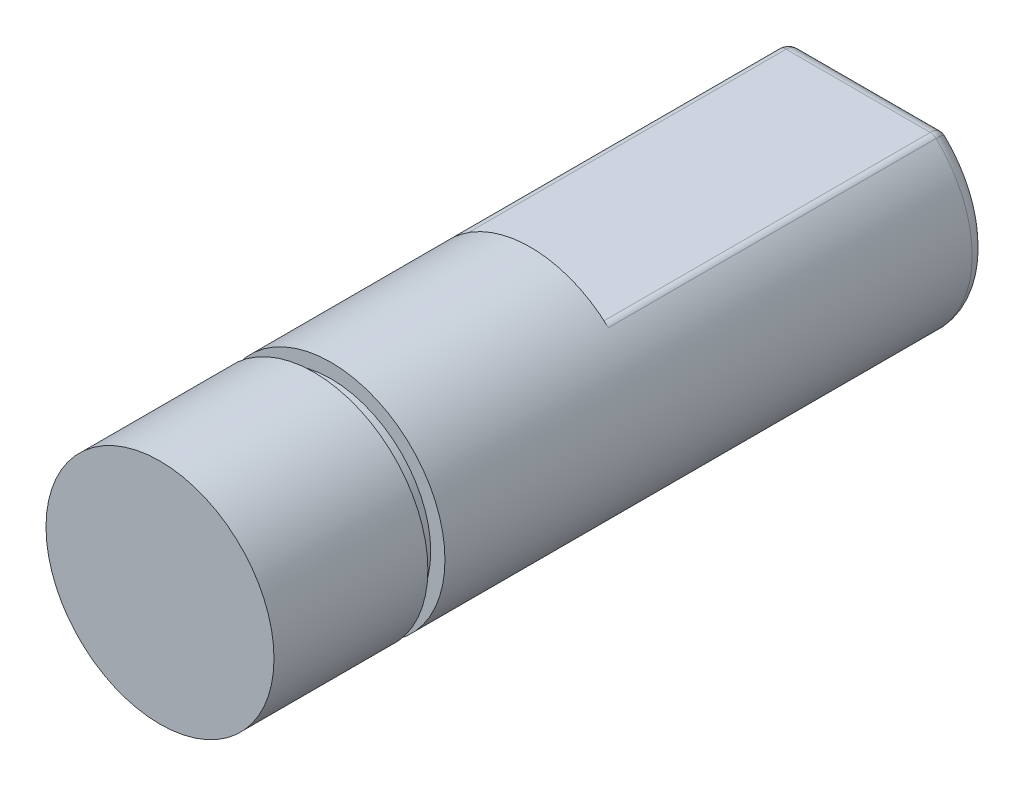
ISO-10303-21;
HEADER;
FILE_DESCRIPTION(('STEP AP214'),'2;1');
FILE_NAME('part.step','',(''),(''),'','','');
FILE_SCHEMA(('AUTOMOTIVE_DESIGN { 1 0 10303 214 1 1 1 1 }'));
ENDSEC;
DATA;
#1=APPLICATION_CONTEXT('core data for automotive mechanical design processes');
#2=APPLICATION_PROTOCOL_DEFINITION('international standard','automotive_design',2000,#1);
#3=PRODUCT_CONTEXT('',#1,'mechanical');
#4=PRODUCT('Part','Part','',(#3));
#5=PRODUCT_RELATED_PRODUCT_CATEGORY('part','',(#4));
#6=PRODUCT_DEFINITION_FORMATION('','',#4);
#7=PRODUCT_DEFINITION_CONTEXT('part definition',#1,'design');
#8=PRODUCT_DEFINITION('design','',#6,#7);
#9=PRODUCT_DEFINITION_SHAPE('','',#8);
#10=(LENGTH_UNIT() NAMED_UNIT(*) SI_UNIT(.MILLI.,.METRE.));
#11=(NAMED_UNIT(*) PLANE_ANGLE_UNIT() SI_UNIT($,.RADIAN.));
#12=(NAMED_UNIT(*) SI_UNIT($,.STERADIAN.) SOLID_ANGLE_UNIT());
#13=UNCERTAINTY_MEASURE_WITH_UNIT(LENGTH_MEASURE(1.E-05),#10,'distance_accuracy_value','');
#14=(GEOMETRIC_REPRESENTATION_CONTEXT(3) GLOBAL_UNCERTAINTY_ASSIGNED_CONTEXT((#13)) GLOBAL_UNIT_ASSIGNED_CONTEXT((#10,
#11,#12)) REPRESENTATION_CONTEXT('',''));
#15=CARTESIAN_POINT('',(0.,0.,0.));
#16=DIRECTION('',(0.,0.,1.));
#17=DIRECTION('',(1.,0.,0.));
#18=AXIS2_PLACEMENT_3D('',#15,#16,#17);
#19=CARTESIAN_POINT('',(0.,0.,25.));
#20=DIRECTION('',(0.,0.,-1.));
#21=DIRECTION('',(-1.,0.,0.));
#22=AXIS2_PLACEMENT_3D('',#19,#20,#21);
#23=CYLINDRICAL_SURFACE('',#22,4.);
#24=CARTESIAN_POINT('',(0.,0.,19.6));
#25=DIRECTION('',(0.,0.,-1.));
#26=DIRECTION('',(-1.,0.,0.));
#27=AXIS2_PLACEMENT_3D('',#24,#25,#26);
#28=CIRCLE('',#27,4.);
#29=CARTESIAN_POINT('',(-4.,0.,19.6));
#30=VERTEX_POINT('',#29);
#31=EDGE_CURVE('E189',#30,#30,#28,.T.);
#32=ORIENTED_EDGE('',*,*,#31,.F.);
#33=EDGE_LOOP('',(#32));
#34=FACE_BOUND('',#33,.T.);
#35=CARTESIAN_POINT('',(0.,0.,25.));
#36=DIRECTION('',(0.,0.,1.));
#37=DIRECTION('',(1.,0.,0.));
#38=AXIS2_PLACEMENT_3D('',#35,#36,#37);
#39=CIRCLE('',#38,4.);
#40=CARTESIAN_POINT('',(4.,0.,25.));
#41=VERTEX_POINT('',#40);
#42=EDGE_CURVE('E207',#41,#41,#39,.T.);
#43=ORIENTED_EDGE('',*,*,#42,.F.);
#44=EDGE_LOOP('',(#43));
#45=FACE_BOUND('',#44,.T.);
#46=ADVANCED_FACE('F34',(#34,#45),#23,.T.);
#47=CARTESIAN_POINT('',(0.,0.,25.));
#48=DIRECTION('',(0.,0.,1.));
#49=DIRECTION('',(1.,0.,0.));
#50=AXIS2_PLACEMENT_3D('',#47,#48,#49);
#51=PLANE('',#50);
#52=ORIENTED_EDGE('',*,*,#42,.T.);
#53=EDGE_LOOP('',(#52));
#54=FACE_BOUND('',#53,.T.);
#55=ADVANCED_FACE('F231',(#54),#51,.T.);
#56=CARTESIAN_POINT('',(0.,4.,19.6));
#57=DIRECTION('',(0.,0.,1.));
#58=DIRECTION('',(1.,0.,0.));
#59=AXIS2_PLACEMENT_3D('',#56,#57,#58);
#60=PLANE('',#59);
#61=CARTESIAN_POINT('',(0.,0.,19.6));
#62=DIRECTION('',(0.,0.,-1.));
#63=DIRECTION('',(-1.,0.,0.));
#64=AXIS2_PLACEMENT_3D('',#61,#62,#63);
#65=CIRCLE('',#64,3.5);
#66=CARTESIAN_POINT('',(-3.5,0.,19.6));
#67=VERTEX_POINT('',#66);
#68=EDGE_CURVE('E202',#67,#67,#65,.T.);
#69=ORIENTED_EDGE('',*,*,#68,.F.);
#70=EDGE_LOOP('',(#69));
#71=FACE_BOUND('',#70,.T.);
#72=ORIENTED_EDGE('',*,*,#31,.T.);
#73=EDGE_LOOP('',(#72));
#74=FACE_BOUND('',#73,.T.);
#75=ADVANCED_FACE('F236',(#71,#74),#60,.F.);
#76=CARTESIAN_POINT('',(0.,0.,0.));
#77=DIRECTION('',(0.,0.,-1.));
#78=DIRECTION('',(-1.,0.,0.));
#79=AXIS2_PLACEMENT_3D('',#76,#77,#78);
#80=CYLINDRICAL_SURFACE('',#79,3.5);
#81=CARTESIAN_POINT('',(0.,0.,19.));
#82=DIRECTION('',(0.,0.,-1.));
#83=DIRECTION('',(-1.,0.,0.));
#84=AXIS2_PLACEMENT_3D('',#81,#82,#83);
#85=CIRCLE('',#84,3.5);
#86=CARTESIAN_POINT('',(-3.5,0.,19.));
#87=VERTEX_POINT('',#86);
#88=EDGE_CURVE('E199',#87,#87,#85,.T.);
#89=ORIENTED_EDGE('',*,*,#88,.F.);
#90=EDGE_LOOP('',(#89));
#91=FACE_BOUND('',#90,.T.);
#92=ORIENTED_EDGE('',*,*,#68,.T.);
#93=EDGE_LOOP('',(#92));
#94=FACE_BOUND('',#93,.T.);
#95=ADVANCED_FACE('F253',(#91,#94),#80,.T.);
#96=CARTESIAN_POINT('',(0.,4.,19.));
#97=DIRECTION('',(0.,0.,-1.));
#98=DIRECTION('',(-1.,0.,0.));
#99=AXIS2_PLACEMENT_3D('',#96,#97,#98);
#100=PLANE('',#99);
#101=CARTESIAN_POINT('',(0.,0.,19.));
#102=DIRECTION('',(0.,0.,-1.));
#103=DIRECTION('',(-1.,0.,0.));
#104=AXIS2_PLACEMENT_3D('',#101,#102,#103);
#105=CIRCLE('',#104,4.);
#106=CARTESIAN_POINT('',(-4.,0.,19.));
#107=VERTEX_POINT('',#106);
#108=EDGE_CURVE('E194',#107,#107,#105,.T.);
#109=ORIENTED_EDGE('',*,*,#108,.F.);
#110=EDGE_LOOP('',(#109));
#111=FACE_BOUND('',#110,.T.);
#112=ORIENTED_EDGE('',*,*,#88,.T.);
#113=EDGE_LOOP('',(#112));
#114=FACE_BOUND('',#113,.T.);
#115=ADVANCED_FACE('F248',(#111,#114),#100,.F.);
#116=CARTESIAN_POINT('',(-4.,4.,12.));
#117=DIRECTION('',(0.,0.,1.));
#118=DIRECTION('',(1.,0.,0.));
#119=AXIS2_PLACEMENT_3D('',#116,#117,#118);
#120=PLANE('',#119);
#121=DIRECTION('',(1.,0.,0.));
#122=VECTOR('',#121,1.);
#123=CARTESIAN_POINT('',(-4.,3.,12.));
#124=LINE('',#123,#122);
#125=CARTESIAN_POINT('',(-2.52982212813471,3.,12.));
#126=VERTEX_POINT('',#125);
#127=CARTESIAN_POINT('',(2.52982212813471,3.,12.));
#128=VERTEX_POINT('',#127);
#129=EDGE_CURVE('E205',#126,#128,#124,.T.);
#130=ORIENTED_EDGE('',*,*,#129,.F.);
#131=CARTESIAN_POINT('',(-2.52982212813471,2.7,12.));
#132=DIRECTION('',(0.,0.,1.));
#133=DIRECTION('',(1.,0.,0.));
#134=AXIS2_PLACEMENT_3D('',#131,#132,#133);
#135=CIRCLE('',#134,0.3);
#136=CARTESIAN_POINT('',(-2.73494284122671,2.91891891891892,12.));
#137=VERTEX_POINT('',#136);
#138=EDGE_CURVE('E48',#126,#137,#135,.T.);
#139=ORIENTED_EDGE('',*,*,#138,.T.);
#140=CARTESIAN_POINT('',(0.,0.,12.));
#141=DIRECTION('',(0.,0.,1.));
#142=DIRECTION('',(1.,0.,0.));
#143=AXIS2_PLACEMENT_3D('',#140,#141,#142);
#144=CIRCLE('',#143,4.);
#145=CARTESIAN_POINT('',(2.73494284122671,2.91891891891892,12.));
#146=VERTEX_POINT('',#145);
#147=EDGE_CURVE('E210',#146,#137,#144,.T.);
#148=ORIENTED_EDGE('',*,*,#147,.F.);
#149=CARTESIAN_POINT('',(2.52982212813471,2.7,12.));
#150=DIRECTION('',(0.,0.,1.));
#151=DIRECTION('',(1.,0.,0.));
#152=AXIS2_PLACEMENT_3D('',#149,#150,#151);
#153=CIRCLE('',#152,0.3);
#154=EDGE_CURVE('E11',#146,#128,#153,.T.);
#155=ORIENTED_EDGE('',*,*,#154,.T.);
#156=EDGE_LOOP('',(#130,#139,#148,#155));
#157=FACE_BOUND('',#156,.T.);
#158=ADVANCED_FACE('F245',(#157),#120,.F.);
#159=CARTESIAN_POINT('',(-4.,3.,0.));
#160=DIRECTION('',(0.,-1.,0.));
#161=DIRECTION('',(0.,0.,-1.));
#162=AXIS2_PLACEMENT_3D('',#159,#160,#161);
#163=PLANE('',#162);
#164=DIRECTION('',(1.,0.,0.));
#165=VECTOR('',#164,1.);
#166=CARTESIAN_POINT('',(-4.,3.,0.5));
#167=LINE('',#166,#165);
#168=CARTESIAN_POINT('',(2.52982212813471,3.,0.5));
#169=VERTEX_POINT('',#168);
#170=CARTESIAN_POINT('',(-2.52982212813471,3.,0.5));
#171=VERTEX_POINT('',#170);
#172=EDGE_CURVE('E108',#169,#171,#167,.F.);
#173=ORIENTED_EDGE('',*,*,#172,.T.);
#174=DIRECTION('',(0.,0.,-1.));
#175=VECTOR('',#174,1.);
#176=CARTESIAN_POINT('',(-2.52982212813471,3.,0.));
#177=LINE('',#176,#175);
#178=EDGE_CURVE('E61',#171,#126,#177,.F.);
#179=ORIENTED_EDGE('',*,*,#178,.T.);
#180=ORIENTED_EDGE('',*,*,#129,.T.);
#181=DIRECTION('',(0.,0.,-1.));
#182=VECTOR('',#181,1.);
#183=CARTESIAN_POINT('',(2.52982212813471,3.,0.));
#184=LINE('',#183,#182);
#185=EDGE_CURVE('E277',#128,#169,#184,.T.);
#186=ORIENTED_EDGE('',*,*,#185,.T.);
#187=EDGE_LOOP('',(#173,#179,#180,#186));
#188=FACE_BOUND('',#187,.T.);
#189=ADVANCED_FACE('F243',(#188),#163,.F.);
#190=CARTESIAN_POINT('',(0.,0.,0.));
#191=DIRECTION('',(0.,0.,1.));
#192=DIRECTION('',(1.,0.,0.));
#193=AXIS2_PLACEMENT_3D('',#190,#191,#192);
#194=PLANE('',#193);
#195=CARTESIAN_POINT('',(0.,0.,0.));
#196=DIRECTION('',(0.,0.,1.));
#197=DIRECTION('',(1.,0.,0.));
#198=AXIS2_PLACEMENT_3D('',#195,#196,#197);
#199=CIRCLE('',#198,3.5);
#200=CARTESIAN_POINT('',(2.44948974278318,2.5,0.));
#201=VERTEX_POINT('',#200);
#202=CARTESIAN_POINT('',(-2.44948974278318,2.5,0.));
#203=VERTEX_POINT('',#202);
#204=EDGE_CURVE('E112',#201,#203,#199,.F.);
#205=ORIENTED_EDGE('',*,*,#204,.T.);
#206=DIRECTION('',(1.,0.,0.));
#207=VECTOR('',#206,1.);
#208=CARTESIAN_POINT('',(0.,2.5,0.));
#209=LINE('',#208,#207);
#210=EDGE_CURVE('E106',#203,#201,#209,.T.);
#211=ORIENTED_EDGE('',*,*,#210,.T.);
#212=EDGE_LOOP('',(#205,#211));
#213=FACE_BOUND('',#212,.T.);
#214=CARTESIAN_POINT('',(0.,0.,0.));
#215=DIRECTION('',(0.,0.,1.));
#216=DIRECTION('',(1.,0.,0.));
#217=AXIS2_PLACEMENT_3D('',#214,#215,#216);
#218=CIRCLE('',#217,2.);
#219=CARTESIAN_POINT('',(2.,0.,0.));
#220=VERTEX_POINT('',#219);
#221=EDGE_CURVE('E116',#220,#220,#218,.T.);
#222=ORIENTED_EDGE('',*,*,#221,.T.);
#223=EDGE_LOOP('',(#222));
#224=FACE_BOUND('',#223,.T.);
#225=ADVANCED_FACE('F118',(#213,#224),#194,.F.);
#226=ORIENTED_EDGE('',*,*,#108,.T.);
#227=EDGE_LOOP('',(#226));
#228=FACE_BOUND('',#227,.T.);
#229=ORIENTED_EDGE('',*,*,#147,.T.);
#230=DIRECTION('',(0.,0.,-1.));
#231=VECTOR('',#230,1.);
#232=CARTESIAN_POINT('',(-2.73494284122671,2.91891891891892,25.));
#233=LINE('',#232,#231);
#234=CARTESIAN_POINT('',(-2.73494284122671,2.91891891891892,0.5));
#235=VERTEX_POINT('',#234);
#236=EDGE_CURVE('E271',#137,#235,#233,.T.);
#237=ORIENTED_EDGE('',*,*,#236,.T.);
#238=CARTESIAN_POINT('',(0.,0.,0.5));
#239=DIRECTION('',(0.,0.,1.));
#240=DIRECTION('',(1.,0.,0.));
#241=AXIS2_PLACEMENT_3D('',#238,#239,#240);
#242=CIRCLE('',#241,4.);
#243=CARTESIAN_POINT('',(2.73494284122671,2.91891891891892,0.5));
#244=VERTEX_POINT('',#243);
#245=EDGE_CURVE('E121',#235,#244,#242,.T.);
#246=ORIENTED_EDGE('',*,*,#245,.T.);
#247=DIRECTION('',(0.,0.,-1.));
#248=VECTOR('',#247,1.);
#249=CARTESIAN_POINT('',(2.73494284122671,2.91891891891892,25.));
#250=LINE('',#249,#248);
#251=EDGE_CURVE('E273',#244,#146,#250,.F.);
#252=ORIENTED_EDGE('',*,*,#251,.T.);
#253=EDGE_LOOP('',(#229,#237,#246,#252));
#254=FACE_BOUND('',#253,.T.);
#255=ADVANCED_FACE('F221',(#228,#254),#23,.T.);
#256=CARTESIAN_POINT('',(0.,0.,3.));
#257=DIRECTION('',(0.,0.,-1.));
#258=DIRECTION('',(-1.,0.,0.));
#259=AXIS2_PLACEMENT_3D('',#256,#257,#258);
#260=CYLINDRICAL_SURFACE('',#259,1.5);
#261=CARTESIAN_POINT('',(0.,0.,0.5));
#262=DIRECTION('',(0.,0.,1.));
#263=DIRECTION('',(1.,0.,0.));
#264=AXIS2_PLACEMENT_3D('',#261,#262,#263);
#265=CIRCLE('',#264,1.5);
#266=CARTESIAN_POINT('',(1.5,0.,0.5));
#267=VERTEX_POINT('',#266);
#268=EDGE_CURVE('E109',#267,#267,#265,.F.);
#269=ORIENTED_EDGE('',*,*,#268,.T.);
#270=EDGE_LOOP('',(#269));
#271=FACE_BOUND('',#270,.T.);
#272=CARTESIAN_POINT('',(0.,0.,3.));
#273=DIRECTION('',(0.,0.,-1.));
#274=DIRECTION('',(-1.,0.,0.));
#275=AXIS2_PLACEMENT_3D('',#272,#273,#274);
#276=CIRCLE('',#275,1.5);
#277=CARTESIAN_POINT('',(-1.5,0.,3.));
#278=VERTEX_POINT('',#277);
#279=EDGE_CURVE('E186',#278,#278,#276,.T.);
#280=ORIENTED_EDGE('',*,*,#279,.F.);
#281=EDGE_LOOP('',(#280));
#282=FACE_BOUND('',#281,.T.);
#283=ADVANCED_FACE('F218',(#271,#282),#260,.F.);
#284=CARTESIAN_POINT('',(0.,0.,3.));
#285=DIRECTION('',(0.,0.,-1.));
#286=DIRECTION('',(-1.,0.,0.));
#287=AXIS2_PLACEMENT_3D('',#284,#285,#286);
#288=PLANE('',#287);
#289=ORIENTED_EDGE('',*,*,#279,.T.);
#290=EDGE_LOOP('',(#289));
#291=FACE_BOUND('',#290,.T.);
#292=ADVANCED_FACE('F158',(#291),#288,.T.);
#293=CARTESIAN_POINT('',(0.,0.,0.5));
#294=DIRECTION('',(0.,0.,1.));
#295=DIRECTION('',(1.,0.,0.));
#296=AXIS2_PLACEMENT_3D('',#293,#294,#295);
#297=TOROIDAL_SURFACE('',#296,3.5,0.5);
#298=ORIENTED_EDGE('',*,*,#245,.F.);
#299=CARTESIAN_POINT('',(-2.44948974278318,2.5,0.));
#300=CARTESIAN_POINT('',(-2.44948974278318,2.5,0.));
#301=CARTESIAN_POINT('',(-2.44948974278318,2.5,0.));
#302=CARTESIAN_POINT('',(-2.45101060180602,2.50216063695077,-2.41608440944609E-07));
#303=CARTESIAN_POINT('',(-2.45046309124047,2.50238416575963,-7.11530875121072E-08));
#304=CARTESIAN_POINT('',(-2.44991558168085,2.5026076877564,-2.41608442035622E-07));
#305=CARTESIAN_POINT('',(-2.45253149415956,2.5043225163041,2.01789761310637E-05));
#306=CARTESIAN_POINT('',(-2.45143649078591,2.50476947286089,1.68381308383471E-05));
#307=CARTESIAN_POINT('',(-2.45034146594023,2.50521636825447,2.01789761302857E-05));
#308=CARTESIAN_POINT('',(-2.48857411518307,2.55558347471764,0.000993485656571443));
#309=CARTESIAN_POINT('',(-2.4745119249592,2.56133947588754,0.000820961988483815));
#310=CARTESIAN_POINT('',(-2.46043505975079,2.56705969652974,0.000993485656599383));
#311=CARTESIAN_POINT('',(-2.52301790373466,2.60517962001986,0.0125650565931051));
#312=CARTESIAN_POINT('',(-2.49673522087624,2.61634085711889,0.0103939379423477));
#313=CARTESIAN_POINT('',(-2.47009927471236,2.62663668893363,0.0125650565936237));
#314=CARTESIAN_POINT('',(-2.58747109746088,2.69898022412864,0.0566401041228485));
#315=CARTESIAN_POINT('',(-2.53936220633057,2.72271990976705,0.0483896145653747));
#316=CARTESIAN_POINT('',(-2.48821367023174,2.73890534692689,0.0566401041223316));
#317=CARTESIAN_POINT('',(-2.6174739451686,2.74317669333226,0.0891741620078501));
#318=CARTESIAN_POINT('',(-2.5599469978289,2.77456167733762,0.0772447218419461));
#319=CARTESIAN_POINT('',(-2.49666205500175,2.79158681761686,0.0891741620058042));
#320=CARTESIAN_POINT('',(-2.66076294671172,2.80742825128708,0.158919437191818));
#321=CARTESIAN_POINT('',(-2.59084545070239,2.85283081329819,0.142600763702393));
#322=CARTESIAN_POINT('',(-2.50886638969633,2.86798201332467,0.158919437193205));
#323=CARTESIAN_POINT('',(-2.67631982828862,2.83067235484295,0.191239281592447));
#324=CARTESIAN_POINT('',(-2.60237503525097,2.88217913714422,0.173929878527584));
#325=CARTESIAN_POINT('',(-2.51325698733929,2.89555878179232,0.191239281596863));
#326=CARTESIAN_POINT('',(-2.69745517824265,2.86236480821899,0.248796103907054));
#327=CARTESIAN_POINT('',(-2.61846047910425,2.92323314518361,0.231652531498794));
#328=CARTESIAN_POINT('',(-2.51922545293655,2.93311464727483,0.248796103904325));
#329=CARTESIAN_POINT('',(-2.70457536330435,2.87307339581139,0.272023283069402));
#330=CARTESIAN_POINT('',(-2.624001040709,2.93740438634892,0.255444769979618));
#331=CARTESIAN_POINT('',(-2.52123711427055,2.94579209754904,0.272023283061102));
#332=CARTESIAN_POINT('',(-2.71668851458749,2.89132162195643,0.320410919141451));
#333=CARTESIAN_POINT('',(-2.63357014801954,2.96190894092422,0.305916573615632));
#334=CARTESIAN_POINT('',(-2.52466036311647,2.96738374749213,0.32041091913373));
#335=CARTESIAN_POINT('',(-2.72168362797888,2.89886445907541,0.345569394177169));
#336=CARTESIAN_POINT('',(-2.63758359792594,2.97220376369797,0.332569699577252));
#337=CARTESIAN_POINT('',(-2.52607255632709,2.97630174562374,0.345569394175586));
#338=CARTESIAN_POINT('',(-2.72937879785919,2.91049481902136,0.397200866996071));
#339=CARTESIAN_POINT('',(-2.6438287391559,2.98823317730761,0.387975921409005));
#340=CARTESIAN_POINT('',(-2.52824841180903,2.99004853491872,0.397200866997658));
#341=CARTESIAN_POINT('',(-2.73207448903818,2.91457576959176,0.423676264527595));
#342=CARTESIAN_POINT('',(-2.64604280175709,2.99392259766828,0.416678865281229));
#343=CARTESIAN_POINT('',(-2.52901084054046,2.9948695481469,0.423676264526195));
#344=CARTESIAN_POINT('',(-2.73505422038158,2.91908727017659,0.477133906019085));
#345=CARTESIAN_POINT('',(-2.64849882900591,3.00023432019546,0.474982014853981));
#346=CARTESIAN_POINT('',(-2.5298536217225,3.00019898107199,0.477133906007175));
#347=CARTESIAN_POINT('',(-2.73533777217675,2.91951708096989,0.504116251509103));
#348=CARTESIAN_POINT('',(-2.6487340210116,3.00083921915054,0.504508071163013));
#349=CARTESIAN_POINT('',(-2.52993383604987,3.00070652745099,0.504116251489671));
#350=CARTESIAN_POINT('',(-2.73349877693654,2.91673194321977,0.557124453738696));
#351=CARTESIAN_POINT('',(-2.64721521108253,2.99693528899326,0.562420810918379));
#352=CARTESIAN_POINT('',(-2.52941367444204,2.99741674474914,0.557124453757667));
#353=CARTESIAN_POINT('',(-2.73143332942968,2.91360348889957,0.583157791716985));
#354=CARTESIAN_POINT('',(-2.64551222682909,2.99255761291208,0.590744615420721));
#355=CARTESIAN_POINT('',(-2.52882944970177,2.9937215752486,0.583157791780614));
#356=CARTESIAN_POINT('',(-2.72507834997898,2.90399420989767,0.634222791656945));
#357=CARTESIAN_POINT('',(-2.64033028948917,2.9792527302547,0.645846558326992));
#358=CARTESIAN_POINT('',(-2.5270324046197,2.98236535334493,0.634222791755803));
#359=CARTESIAN_POINT('',(-2.72078733761379,2.89751115377835,0.659253774909768));
#360=CARTESIAN_POINT('',(-2.63686175778601,2.97035225344019,0.672568437931883));
#361=CARTESIAN_POINT('',(-2.52581916586487,2.97470166112937,0.659253774999161));
#362=CARTESIAN_POINT('',(-2.71542999078578,2.88942950609024,0.683416282339803));
#363=CARTESIAN_POINT('',(-2.63257789197072,2.9593716489173,0.69805366795812));
#364=CARTESIAN_POINT('',(-2.52430481379162,2.96514349116444,0.683416282339804));
#365=(BOUNDED_SURFACE() B_SPLINE_SURFACE(3,2,((#299,#300,#301),(#302,#303,#304),(#305,#306,
#307),(#308,#309,#310),(#311,#312,#313),(#314,#315,#316),(#317,#318,#319),(#320,#321,#322),
(#323,#324,#325),(#326,#327,#328),(#329,#330,#331),(#332,#333,#334),(#335,#336,#337),(#338,#339,
#340),(#341,#342,#343),(#344,#345,#346),(#347,#348,#349),(#350,#351,#352),(#353,#354,#355),
(#356,#357,#358),(#359,#360,#361),(#362,#363,#364)),.UNSPECIFIED.,.F.,.F.,
.F.) B_SPLINE_SURFACE_WITH_KNOTS((4,2,2,2,2,2,2,2,2,2,4),(3,3),(0.,0.00338105788046479,
0.0801334367618357,0.156998040766858,0.209076075631522,0.241262629494802,0.273416584415206,
0.305631446617626,0.337852830985992,0.369307413857316,0.400782946858097),(0.,1.),
.UNSPECIFIED.) GEOMETRIC_REPRESENTATION_ITEM() RATIONAL_B_SPLINE_SURFACE(((1.,1.,1.),(1.,
1.00000024076302,1.),(1.,0.999994391941989,1.),(1.,0.999712967035755,1.),(1.,0.996338449540727,
1.),(1.,0.984875184260524,1.),(1.,0.976779550677771,1.),(1.,0.962432723122972,1.),(1.,
0.95642859432661,1.),(1.,0.947615753111108,1.),(1.,0.944462475916204,1.),(1.,0.938918298178806,
1.),(1.,0.936526628726334,1.),(1.,0.9327795717778,1.),(1.,0.931426155829298,1.),(1.,
0.929926826103185,1.),(1.,0.929781156849875,1.),(1.,0.930711181299193,1.),(1.,0.931757891618597,
1.),(1.,0.934879666274328,1.),(1.,0.936955415075122,1.),(1.,0.939471717957514,1.))) REPRESENTATION_ITEM('') SURFACE());
#366=CARTESIAN_POINT('',(-2.71542999078578,2.88942950609024,0.683416282339803));
#367=CARTESIAN_POINT('',(-2.72078733761379,2.89751115377835,0.659253774909768));
#368=CARTESIAN_POINT('',(-2.72507834997898,2.90399420989767,0.634222791656945));
#369=CARTESIAN_POINT('',(-2.73143332942968,2.91360348889957,0.583157791716985));
#370=CARTESIAN_POINT('',(-2.73349877693654,2.91673194321977,0.557124453738696));
#371=CARTESIAN_POINT('',(-2.73533777217675,2.91951708096989,0.504116251509103));
#372=CARTESIAN_POINT('',(-2.73505422038158,2.91908727017659,0.477133906019085));
#373=CARTESIAN_POINT('',(-2.73207448903818,2.91457576959176,0.423676264527595));
#374=CARTESIAN_POINT('',(-2.72937879785919,2.91049481902136,0.397200866996071));
#375=CARTESIAN_POINT('',(-2.72168362797888,2.89886445907541,0.345569394177169));
#376=CARTESIAN_POINT('',(-2.71668851458749,2.89132162195643,0.320410919141451));
#377=CARTESIAN_POINT('',(-2.70457536330435,2.87307339581139,0.272023283069402));
#378=CARTESIAN_POINT('',(-2.69745517824265,2.86236480821899,0.248796103907054));
#379=CARTESIAN_POINT('',(-2.67631982828862,2.83067235484295,0.191239281592447));
#380=CARTESIAN_POINT('',(-2.66076294671172,2.80742825128708,0.158919437191817));
#381=CARTESIAN_POINT('',(-2.6174739451686,2.74317669333226,0.0891741620078501));
#382=CARTESIAN_POINT('',(-2.58747109746088,2.69898022412864,0.0566401041228485));
#383=CARTESIAN_POINT('',(-2.52301790373466,2.60517962001986,0.0125650565931051));
#384=CARTESIAN_POINT('',(-2.48857411518307,2.55558347471764,0.000993485656571443));
#385=CARTESIAN_POINT('',(-2.45253149415956,2.5043225163041,2.01789761310636E-05));
#386=CARTESIAN_POINT('',(-2.45101060180602,2.50216063695077,-2.41608440944747E-07));
#387=CARTESIAN_POINT('',(-2.44948974278318,2.5,0.));
#388=B_SPLINE_CURVE_WITH_KNOTS('',3,(#366,#367,#368,#369,#370,#371,#372,#373,#374,#375,#376,
#377,#378,#379,#380,#381,#382,#383,#384,#385,#386,#387),.UNSPECIFIED.,.F.,.F.,(4,2,2,2,2,2,2,2,
2,2,4),(0.,0.031475533000781,0.0629301158721047,0.095151500240471,0.127366362442891,
0.159520317363295,0.191706871226575,0.243784906091239,0.320649510096261,0.397401888977632,
0.400782946858097),.UNSPECIFIED.);
#389=EDGE_CURVE('E97',#235,#203,#388,.T.);
#390=ORIENTED_EDGE('',*,*,#389,.T.);
#391=ORIENTED_EDGE('',*,*,#204,.F.);
#392=CARTESIAN_POINT('',(2.44948974278318,2.5,0.));
#393=CARTESIAN_POINT('',(2.44948974278318,2.5,0.));
#394=CARTESIAN_POINT('',(2.44948974278318,2.5,0.));
#395=CARTESIAN_POINT('',(2.44991558168085,2.5026076877564,-2.41608442035622E-07));
#396=CARTESIAN_POINT('',(2.45046309124047,2.50238416575963,-7.11530875121072E-08));
#397=CARTESIAN_POINT('',(2.45101060180602,2.50216063695077,-2.41608440944609E-07));
#398=CARTESIAN_POINT('',(2.45034146594023,2.50521636825447,2.01789761302857E-05));
#399=CARTESIAN_POINT('',(2.45143649078591,2.50476947286089,1.68381308383471E-05));
#400=CARTESIAN_POINT('',(2.45253149415956,2.5043225163041,2.01789761310637E-05));
#401=CARTESIAN_POINT('',(2.46043505975079,2.56705969652974,0.000993485656599383));
#402=CARTESIAN_POINT('',(2.4745119249592,2.56133947588754,0.000820961988483815));
#403=CARTESIAN_POINT('',(2.48857411518307,2.55558347471764,0.000993485656571443));
#404=CARTESIAN_POINT('',(2.47009927471236,2.62663668893363,0.0125650565936237));
#405=CARTESIAN_POINT('',(2.49673522087624,2.61634085711889,0.0103939379423477));
#406=CARTESIAN_POINT('',(2.52301790373466,2.60517962001986,0.0125650565931051));
#407=CARTESIAN_POINT('',(2.48821367023174,2.73890534692689,0.0566401041223316));
#408=CARTESIAN_POINT('',(2.53936220633057,2.72271990976705,0.0483896145653747));
#409=CARTESIAN_POINT('',(2.58747109746088,2.69898022412864,0.0566401041228485));
#410=CARTESIAN_POINT('',(2.49666205500175,2.79158681761686,0.0891741620058042));
#411=CARTESIAN_POINT('',(2.5599469978289,2.77456167733762,0.0772447218419461));
#412=CARTESIAN_POINT('',(2.6174739451686,2.74317669333226,0.0891741620078501));
#413=CARTESIAN_POINT('',(2.50886638969633,2.86798201332467,0.158919437193205));
#414=CARTESIAN_POINT('',(2.59084545070239,2.85283081329819,0.142600763702393));
#415=CARTESIAN_POINT('',(2.66076294671172,2.80742825128708,0.158919437191818));
#416=CARTESIAN_POINT('',(2.51325698733929,2.89555878179232,0.191239281596863));
#417=CARTESIAN_POINT('',(2.60237503525097,2.88217913714422,0.173929878527584));
#418=CARTESIAN_POINT('',(2.67631982828862,2.83067235484295,0.191239281592447));
#419=CARTESIAN_POINT('',(2.51922545293655,2.93311464727483,0.248796103904325));
#420=CARTESIAN_POINT('',(2.61846047910425,2.92323314518361,0.231652531498794));
#421=CARTESIAN_POINT('',(2.69745517824265,2.86236480821899,0.248796103907054));
#422=CARTESIAN_POINT('',(2.52123711427055,2.94579209754904,0.272023283061102));
#423=CARTESIAN_POINT('',(2.624001040709,2.93740438634892,0.255444769979618));
#424=CARTESIAN_POINT('',(2.70457536330435,2.87307339581139,0.272023283069402));
#425=CARTESIAN_POINT('',(2.52466036311647,2.96738374749213,0.32041091913373));
#426=CARTESIAN_POINT('',(2.63357014801954,2.96190894092422,0.305916573615632));
#427=CARTESIAN_POINT('',(2.71668851458749,2.89132162195643,0.320410919141451));
#428=CARTESIAN_POINT('',(2.52607255632709,2.97630174562374,0.345569394175586));
#429=CARTESIAN_POINT('',(2.63758359792594,2.97220376369797,0.332569699577252));
#430=CARTESIAN_POINT('',(2.72168362797888,2.89886445907541,0.345569394177169));
#431=CARTESIAN_POINT('',(2.52824841180903,2.99004853491872,0.397200866997658));
#432=CARTESIAN_POINT('',(2.6438287391559,2.98823317730761,0.387975921409005));
#433=CARTESIAN_POINT('',(2.72937879785919,2.91049481902136,0.397200866996071));
#434=CARTESIAN_POINT('',(2.52901084054046,2.9948695481469,0.423676264526195));
#435=CARTESIAN_POINT('',(2.64604280175709,2.99392259766828,0.416678865281229));
#436=CARTESIAN_POINT('',(2.73207448903818,2.91457576959176,0.423676264527595));
#437=CARTESIAN_POINT('',(2.5298536217225,3.00019898107199,0.477133906007175));
#438=CARTESIAN_POINT('',(2.64849882900591,3.00023432019546,0.474982014853981));
#439=CARTESIAN_POINT('',(2.73505422038158,2.91908727017659,0.477133906019085));
#440=CARTESIAN_POINT('',(2.52993383604987,3.00070652745099,0.504116251489671));
#441=CARTESIAN_POINT('',(2.6487340210116,3.00083921915054,0.504508071163013));
#442=CARTESIAN_POINT('',(2.73533777217675,2.91951708096989,0.504116251509103));
#443=CARTESIAN_POINT('',(2.52941367444204,2.99741674474914,0.557124453757667));
#444=CARTESIAN_POINT('',(2.64721521108253,2.99693528899326,0.562420810918379));
#445=CARTESIAN_POINT('',(2.73349877693654,2.91673194321977,0.557124453738696));
#446=CARTESIAN_POINT('',(2.52882944970177,2.9937215752486,0.583157791780614));
#447=CARTESIAN_POINT('',(2.64551222682909,2.99255761291208,0.590744615420721));
#448=CARTESIAN_POINT('',(2.73143332942968,2.91360348889957,0.583157791716985));
#449=CARTESIAN_POINT('',(2.5270324046197,2.98236535334493,0.634222791755803));
#450=CARTESIAN_POINT('',(2.64033028948917,2.9792527302547,0.645846558326992));
#451=CARTESIAN_POINT('',(2.72507834997898,2.90399420989767,0.634222791656945));
#452=CARTESIAN_POINT('',(2.52581916586487,2.97470166112937,0.659253774999161));
#453=CARTESIAN_POINT('',(2.63686175778601,2.97035225344019,0.672568437931883));
#454=CARTESIAN_POINT('',(2.72078733761379,2.89751115377835,0.659253774909768));
#455=CARTESIAN_POINT('',(2.52430481379162,2.96514349116444,0.683416282339804));
#456=CARTESIAN_POINT('',(2.63257789197072,2.9593716489173,0.69805366795812));
#457=CARTESIAN_POINT('',(2.71542999078578,2.88942950609024,0.683416282339803));
#458=(BOUNDED_SURFACE() B_SPLINE_SURFACE(3,2,((#392,#393,#394),(#395,#396,#397),(#398,#399,
#400),(#401,#402,#403),(#404,#405,#406),(#407,#408,#409),(#410,#411,#412),(#413,#414,#415),
(#416,#417,#418),(#419,#420,#421),(#422,#423,#424),(#425,#426,#427),(#428,#429,#430),(#431,#432,
#433),(#434,#435,#436),(#437,#438,#439),(#440,#441,#442),(#443,#444,#445),(#446,#447,#448),
(#449,#450,#451),(#452,#453,#454),(#455,#456,#457)),.UNSPECIFIED.,.F.,.F.,
.F.) B_SPLINE_SURFACE_WITH_KNOTS((4,2,2,2,2,2,2,2,2,2,4),(3,3),(0.,0.00338105788046479,
0.0801334367618357,0.156998040766858,0.209076075631522,0.241262629494802,0.273416584415206,
0.305631446617626,0.337852830985992,0.369307413857316,0.400782946858097),(0.,1.),
.UNSPECIFIED.) GEOMETRIC_REPRESENTATION_ITEM() RATIONAL_B_SPLINE_SURFACE(((1.,1.,1.),(1.,
1.00000024076302,1.),(1.,0.999994391941989,1.),(1.,0.999712967035755,1.),(1.,0.996338449540727,
1.),(1.,0.984875184260524,1.),(1.,0.976779550677771,1.),(1.,0.962432723122972,1.),(1.,
0.95642859432661,1.),(1.,0.947615753111108,1.),(1.,0.944462475916204,1.),(1.,0.938918298178806,
1.),(1.,0.936526628726334,1.),(1.,0.9327795717778,1.),(1.,0.931426155829298,1.),(1.,
0.929926826103185,1.),(1.,0.929781156849875,1.),(1.,0.930711181299193,1.),(1.,0.931757891618597,
1.),(1.,0.934879666274328,1.),(1.,0.936955415075122,1.),(1.,0.939471717957514,1.))) REPRESENTATION_ITEM('') SURFACE());
#459=CARTESIAN_POINT('',(2.71542999078578,2.88942950609024,0.683416282339803));
#460=CARTESIAN_POINT('',(2.72078733761379,2.89751115377835,0.659253774909768));
#461=CARTESIAN_POINT('',(2.72507834997898,2.90399420989767,0.634222791656945));
#462=CARTESIAN_POINT('',(2.73143332942968,2.91360348889957,0.583157791716985));
#463=CARTESIAN_POINT('',(2.73349877693654,2.91673194321977,0.557124453738696));
#464=CARTESIAN_POINT('',(2.73533777217675,2.91951708096989,0.504116251509103));
#465=CARTESIAN_POINT('',(2.73505422038158,2.91908727017659,0.477133906019085));
#466=CARTESIAN_POINT('',(2.73207448903818,2.91457576959176,0.423676264527595));
#467=CARTESIAN_POINT('',(2.72937879785919,2.91049481902136,0.397200866996071));
#468=CARTESIAN_POINT('',(2.72168362797888,2.89886445907541,0.345569394177169));
#469=CARTESIAN_POINT('',(2.71668851458749,2.89132162195643,0.320410919141451));
#470=CARTESIAN_POINT('',(2.70457536330435,2.87307339581139,0.272023283069402));
#471=CARTESIAN_POINT('',(2.69745517824265,2.86236480821899,0.248796103907054));
#472=CARTESIAN_POINT('',(2.67631982828862,2.83067235484295,0.191239281592447));
#473=CARTESIAN_POINT('',(2.66076294671172,2.80742825128708,0.158919437191817));
#474=CARTESIAN_POINT('',(2.6174739451686,2.74317669333226,0.0891741620078501));
#475=CARTESIAN_POINT('',(2.58747109746088,2.69898022412864,0.0566401041228485));
#476=CARTESIAN_POINT('',(2.52301790373466,2.60517962001986,0.0125650565931051));
#477=CARTESIAN_POINT('',(2.48857411518307,2.55558347471764,0.000993485656571443));
#478=CARTESIAN_POINT('',(2.45253149415956,2.5043225163041,2.01789761310636E-05));
#479=CARTESIAN_POINT('',(2.45101060180602,2.50216063695077,-2.41608440944747E-07));
#480=CARTESIAN_POINT('',(2.44948974278318,2.5,0.));
#481=B_SPLINE_CURVE_WITH_KNOTS('',3,(#459,#460,#461,#462,#463,#464,#465,#466,#467,#468,#469,
#470,#471,#472,#473,#474,#475,#476,#477,#478,#479,#480),.UNSPECIFIED.,.F.,.F.,(4,2,2,2,2,2,2,2,
2,2,4),(0.,0.031475533000781,0.0629301158721047,0.095151500240471,0.127366362442891,
0.159520317363295,0.191706871226575,0.243784906091239,0.320649510096261,0.397401888977632,
0.400782946858097),.UNSPECIFIED.);
#482=EDGE_CURVE('E87',#201,#244,#481,.F.);
#483=ORIENTED_EDGE('',*,*,#482,.T.);
#484=EDGE_LOOP('',(#298,#390,#391,#483));
#485=FACE_BOUND('',#484,.T.);
#486=ADVANCED_FACE('F113',(#485),#297,.T.);
#487=CARTESIAN_POINT('',(0.,2.5,0.5));
#488=DIRECTION('',(1.,0.,0.));
#489=DIRECTION('',(0.,0.,-1.));
#490=AXIS2_PLACEMENT_3D('',#487,#488,#489);
#491=CYLINDRICAL_SURFACE('',#490,0.5);
#492=ORIENTED_EDGE('',*,*,#210,.F.);
#493=CARTESIAN_POINT('',(-2.52430481379162,2.96514349116444,0.683416282339804));
#494=CARTESIAN_POINT('',(-2.52581916586487,2.97470166112937,0.659253774999161));
#495=CARTESIAN_POINT('',(-2.5270324046197,2.98236535334493,0.634222791755803));
#496=CARTESIAN_POINT('',(-2.52882944970177,2.9937215752486,0.583157791780614));
#497=CARTESIAN_POINT('',(-2.52941367444204,2.99741674474914,0.557124453757667));
#498=CARTESIAN_POINT('',(-2.52993383604987,3.00070652745099,0.504116251489671));
#499=CARTESIAN_POINT('',(-2.5298536217225,3.00019898107199,0.477133906007175));
#500=CARTESIAN_POINT('',(-2.52901084054046,2.9948695481469,0.423676264526195));
#501=CARTESIAN_POINT('',(-2.52824841180903,2.99004853491872,0.397200866997658));
#502=CARTESIAN_POINT('',(-2.5260725563271,2.97630174562374,0.345569394175586));
#503=CARTESIAN_POINT('',(-2.52466036311647,2.96738374749213,0.32041091913373));
#504=CARTESIAN_POINT('',(-2.52123711427055,2.94579209754904,0.272023283061102));
#505=CARTESIAN_POINT('',(-2.51922545293655,2.93311464727483,0.248796103904325));
#506=CARTESIAN_POINT('',(-2.51325698733929,2.89555878179232,0.191239281596863));
#507=CARTESIAN_POINT('',(-2.50886638969633,2.86798201332467,0.158919437193205));
#508=CARTESIAN_POINT('',(-2.49666205500175,2.79158681761686,0.0891741620058042));
#509=CARTESIAN_POINT('',(-2.48821367023174,2.73890534692689,0.0566401041223316));
#510=CARTESIAN_POINT('',(-2.47009927471236,2.62663668893363,0.0125650565936237));
#511=CARTESIAN_POINT('',(-2.46043505975079,2.56705969652974,0.000993485656599383));
#512=CARTESIAN_POINT('',(-2.45034146594023,2.50521636825447,2.01789761302855E-05));
#513=CARTESIAN_POINT('',(-2.44991558168085,2.5026076877564,-2.4160844203574E-07));
#514=CARTESIAN_POINT('',(-2.44948974278318,2.5,0.));
#515=B_SPLINE_CURVE_WITH_KNOTS('',3,(#493,#494,#495,#496,#497,#498,#499,#500,#501,#502,#503,
#504,#505,#506,#507,#508,#509,#510,#511,#512,#513,#514),.UNSPECIFIED.,.F.,.F.,(4,2,2,2,2,2,2,2,
2,2,4),(0.,0.031475533000781,0.0629301158721047,0.095151500240471,0.127366362442891,
0.159520317363295,0.191706871226575,0.243784906091239,0.320649510096261,0.397401888977632,
0.400782946858097),.UNSPECIFIED.);
#516=EDGE_CURVE('E98',#203,#171,#515,.F.);
#517=ORIENTED_EDGE('',*,*,#516,.T.);
#518=ORIENTED_EDGE('',*,*,#172,.F.);
#519=CARTESIAN_POINT('',(2.52430481379162,2.96514349116444,0.683416282339804));
#520=CARTESIAN_POINT('',(2.52581916586487,2.97470166112937,0.659253774999161));
#521=CARTESIAN_POINT('',(2.5270324046197,2.98236535334493,0.634222791755803));
#522=CARTESIAN_POINT('',(2.52882944970177,2.9937215752486,0.583157791780614));
#523=CARTESIAN_POINT('',(2.52941367444204,2.99741674474914,0.557124453757667));
#524=CARTESIAN_POINT('',(2.52993383604987,3.00070652745099,0.504116251489671));
#525=CARTESIAN_POINT('',(2.5298536217225,3.00019898107199,0.477133906007175));
#526=CARTESIAN_POINT('',(2.52901084054046,2.9948695481469,0.423676264526195));
#527=CARTESIAN_POINT('',(2.52824841180903,2.99004853491872,0.397200866997658));
#528=CARTESIAN_POINT('',(2.5260725563271,2.97630174562374,0.345569394175586));
#529=CARTESIAN_POINT('',(2.52466036311647,2.96738374749213,0.32041091913373));
#530=CARTESIAN_POINT('',(2.52123711427055,2.94579209754904,0.272023283061102));
#531=CARTESIAN_POINT('',(2.51922545293655,2.93311464727483,0.248796103904325));
#532=CARTESIAN_POINT('',(2.51325698733929,2.89555878179232,0.191239281596863));
#533=CARTESIAN_POINT('',(2.50886638969633,2.86798201332467,0.158919437193205));
#534=CARTESIAN_POINT('',(2.49666205500175,2.79158681761686,0.0891741620058042));
#535=CARTESIAN_POINT('',(2.48821367023174,2.73890534692689,0.0566401041223316));
#536=CARTESIAN_POINT('',(2.47009927471236,2.62663668893363,0.0125650565936237));
#537=CARTESIAN_POINT('',(2.46043505975079,2.56705969652974,0.000993485656599383));
#538=CARTESIAN_POINT('',(2.45034146594023,2.50521636825447,2.01789761302855E-05));
#539=CARTESIAN_POINT('',(2.44991558168085,2.5026076877564,-2.4160844203574E-07));
#540=CARTESIAN_POINT('',(2.44948974278318,2.5,0.));
#541=B_SPLINE_CURVE_WITH_KNOTS('',3,(#519,#520,#521,#522,#523,#524,#525,#526,#527,#528,#529,
#530,#531,#532,#533,#534,#535,#536,#537,#538,#539,#540),.UNSPECIFIED.,.F.,.F.,(4,2,2,2,2,2,2,2,
2,2,4),(0.,0.031475533000781,0.0629301158721047,0.095151500240471,0.127366362442891,
0.159520317363295,0.191706871226575,0.243784906091239,0.320649510096261,0.397401888977632,
0.400782946858097),.UNSPECIFIED.);
#542=EDGE_CURVE('E90',#169,#201,#541,.T.);
#543=ORIENTED_EDGE('',*,*,#542,.T.);
#544=EDGE_LOOP('',(#492,#517,#518,#543));
#545=FACE_BOUND('',#544,.T.);
#546=ADVANCED_FACE('F103',(#545),#491,.T.);
#547=CARTESIAN_POINT('',(0.,0.,0.5));
#548=DIRECTION('',(0.,0.,1.));
#549=DIRECTION('',(1.,0.,0.));
#550=AXIS2_PLACEMENT_3D('',#547,#548,#549);
#551=TOROIDAL_SURFACE('',#550,2.,0.5);
#552=ORIENTED_EDGE('',*,*,#221,.F.);
#553=EDGE_LOOP('',(#552));
#554=FACE_BOUND('',#553,.T.);
#555=ORIENTED_EDGE('',*,*,#268,.F.);
#556=EDGE_LOOP('',(#555));
#557=FACE_BOUND('',#556,.T.);
#558=ADVANCED_FACE('F145',(#554,#557),#551,.T.);
#559=CARTESIAN_POINT('',(-2.52982212813471,2.7,25.));
#560=DIRECTION('',(0.,0.,-1.));
#561=DIRECTION('',(-1.,0.,0.));
#562=AXIS2_PLACEMENT_3D('',#559,#560,#561);
#563=CYLINDRICAL_SURFACE('',#562,0.3);
#564=ORIENTED_EDGE('',*,*,#138,.F.);
#565=ORIENTED_EDGE('',*,*,#178,.F.);
#566=CARTESIAN_POINT('',(-2.52982212813471,2.7,0.5));
#567=DIRECTION('',(0.,0.,-1.));
#568=DIRECTION('',(-1.,0.,0.));
#569=AXIS2_PLACEMENT_3D('',#566,#567,#568);
#570=CIRCLE('',#569,0.3);
#571=EDGE_CURVE('E184',#235,#171,#570,.T.);
#572=ORIENTED_EDGE('',*,*,#571,.F.);
#573=ORIENTED_EDGE('',*,*,#236,.F.);
#574=EDGE_LOOP('',(#564,#565,#572,#573));
#575=FACE_BOUND('',#574,.T.);
#576=ADVANCED_FACE('F152',(#575),#563,.T.);
#577=ORIENTED_EDGE('',*,*,#516,.F.);
#578=ORIENTED_EDGE('',*,*,#389,.F.);
#579=ORIENTED_EDGE('',*,*,#571,.T.);
#580=EDGE_LOOP('',(#577,#578,#579));
#581=FACE_BOUND('',#580,.T.);
#582=ADVANCED_FACE('F169',(#581),#365,.T.);
#583=CARTESIAN_POINT('',(2.52982212813471,2.7,25.));
#584=DIRECTION('',(0.,0.,-1.));
#585=DIRECTION('',(-1.,0.,0.));
#586=AXIS2_PLACEMENT_3D('',#583,#584,#585);
#587=CYLINDRICAL_SURFACE('',#586,0.3);
#588=ORIENTED_EDGE('',*,*,#154,.F.);
#589=ORIENTED_EDGE('',*,*,#251,.F.);
#590=CARTESIAN_POINT('',(2.52982212813471,2.7,0.5));
#591=DIRECTION('',(0.,0.,-1.));
#592=DIRECTION('',(-1.,0.,0.));
#593=AXIS2_PLACEMENT_3D('',#590,#591,#592);
#594=CIRCLE('',#593,0.3);
#595=EDGE_CURVE('E92',#169,#244,#594,.T.);
#596=ORIENTED_EDGE('',*,*,#595,.F.);
#597=ORIENTED_EDGE('',*,*,#185,.F.);
#598=EDGE_LOOP('',(#588,#589,#596,#597));
#599=FACE_BOUND('',#598,.T.);
#600=ADVANCED_FACE('F36',(#599),#587,.T.);
#601=ORIENTED_EDGE('',*,*,#595,.T.);
#602=ORIENTED_EDGE('',*,*,#482,.F.);
#603=ORIENTED_EDGE('',*,*,#542,.F.);
#604=EDGE_LOOP('',(#601,#602,#603));
#605=FACE_BOUND('',#604,.T.);
#606=ADVANCED_FACE('F89',(#605),#458,.T.);
#607=CLOSED_SHELL('',(#46,#55,#75,#95,#115,#158,#189,#225,#255,#283,#292,#486,#546,#558,#576,
#582,#600,#606));
#608=MANIFOLD_SOLID_BREP('B2',#607);
#609=ADVANCED_BREP_SHAPE_REPRESENTATION('',(#18,#608),#14);
#610=SHAPE_DEFINITION_REPRESENTATION(#9,#609);
ENDSEC;
END-ISO-10303-21;
